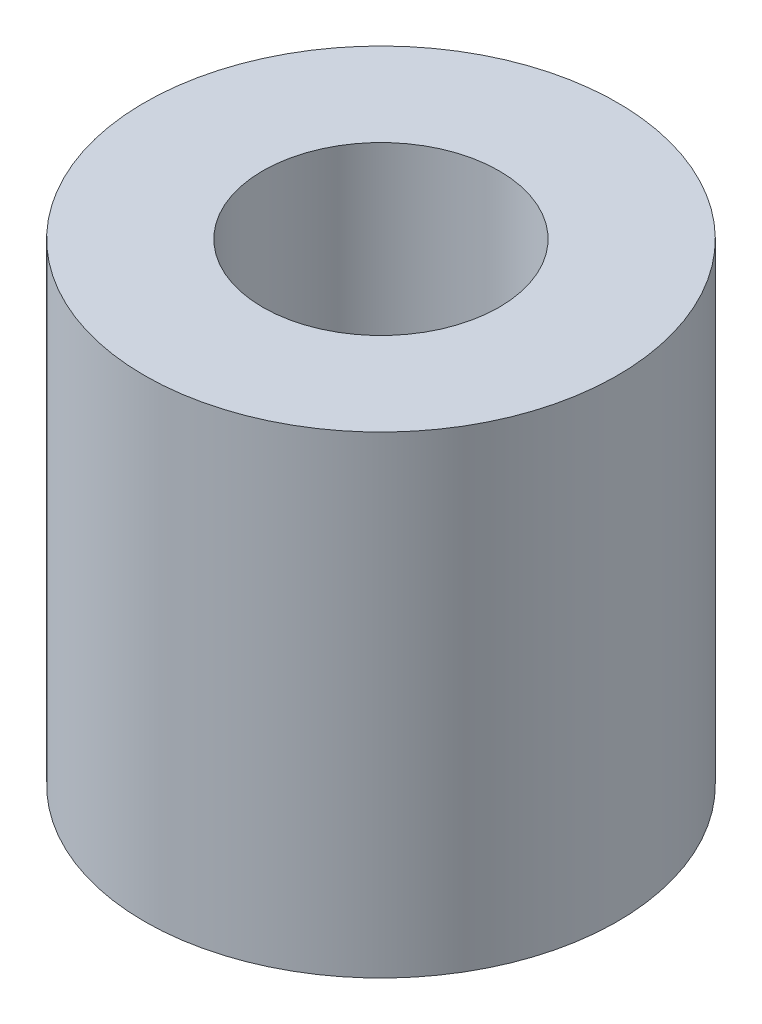
ISO-10303-21;
HEADER;
FILE_DESCRIPTION(('STEP AP214'),'2;1');
FILE_NAME('part.step','',(''),(''),'','','');
FILE_SCHEMA(('AUTOMOTIVE_DESIGN { 1 0 10303 214 1 1 1 1 }'));
ENDSEC;
DATA;
#1=APPLICATION_CONTEXT('core data for automotive mechanical design processes');
#2=APPLICATION_PROTOCOL_DEFINITION('international standard','automotive_design',2000,#1);
#3=PRODUCT_CONTEXT('',#1,'mechanical');
#4=PRODUCT('Part','Part','',(#3));
#5=PRODUCT_RELATED_PRODUCT_CATEGORY('part','',(#4));
#6=PRODUCT_DEFINITION_FORMATION('','',#4);
#7=PRODUCT_DEFINITION_CONTEXT('part definition',#1,'design');
#8=PRODUCT_DEFINITION('design','',#6,#7);
#9=PRODUCT_DEFINITION_SHAPE('','',#8);
#10=(LENGTH_UNIT() NAMED_UNIT(*) SI_UNIT(.MILLI.,.METRE.));
#11=(NAMED_UNIT(*) PLANE_ANGLE_UNIT() SI_UNIT($,.RADIAN.));
#12=(NAMED_UNIT(*) SI_UNIT($,.STERADIAN.) SOLID_ANGLE_UNIT());
#13=UNCERTAINTY_MEASURE_WITH_UNIT(LENGTH_MEASURE(1.E-05),#10,'distance_accuracy_value','');
#14=(GEOMETRIC_REPRESENTATION_CONTEXT(3) GLOBAL_UNCERTAINTY_ASSIGNED_CONTEXT((#13)) GLOBAL_UNIT_ASSIGNED_CONTEXT((#10,
#11,#12)) REPRESENTATION_CONTEXT('',''));
#15=CARTESIAN_POINT('',(0.,0.,0.));
#16=DIRECTION('',(0.,0.,1.));
#17=DIRECTION('',(1.,0.,0.));
#18=AXIS2_PLACEMENT_3D('',#15,#16,#17);
#19=CARTESIAN_POINT('',(0.,12.7,0.));
#20=DIRECTION('',(0.,1.,0.));
#21=DIRECTION('',(0.,0.,1.));
#22=AXIS2_PLACEMENT_3D('',#19,#20,#21);
#23=PLANE('',#22);
#24=CARTESIAN_POINT('',(0.,12.7,0.));
#25=DIRECTION('',(0.,1.,0.));
#26=DIRECTION('',(0.,0.,1.));
#27=AXIS2_PLACEMENT_3D('',#24,#25,#26);
#28=CIRCLE('',#27,6.35);
#29=CARTESIAN_POINT('',(0.,12.7,6.35));
#30=VERTEX_POINT('',#29);
#31=EDGE_CURVE('E10',#30,#30,#28,.T.);
#32=ORIENTED_EDGE('',*,*,#31,.T.);
#33=EDGE_LOOP('',(#32));
#34=FACE_BOUND('',#33,.T.);
#35=CARTESIAN_POINT('',(0.,12.7,0.));
#36=DIRECTION('',(0.,1.,0.));
#37=DIRECTION('',(0.,0.,1.));
#38=AXIS2_PLACEMENT_3D('',#35,#36,#37);
#39=CIRCLE('',#38,3.175);
#40=CARTESIAN_POINT('',(0.,12.7,3.175));
#41=VERTEX_POINT('',#40);
#42=EDGE_CURVE('E42',#41,#41,#39,.T.);
#43=ORIENTED_EDGE('',*,*,#42,.F.);
#44=EDGE_LOOP('',(#43));
#45=FACE_BOUND('',#44,.T.);
#46=ADVANCED_FACE('F31',(#34,#45),#23,.T.);
#47=CARTESIAN_POINT('',(0.,0.,0.));
#48=DIRECTION('',(0.,1.,0.));
#49=DIRECTION('',(0.,0.,1.));
#50=AXIS2_PLACEMENT_3D('',#47,#48,#49);
#51=PLANE('',#50);
#52=CARTESIAN_POINT('',(0.,0.,0.));
#53=DIRECTION('',(0.,1.,0.));
#54=DIRECTION('',(0.,0.,1.));
#55=AXIS2_PLACEMENT_3D('',#52,#53,#54);
#56=CIRCLE('',#55,6.35);
#57=CARTESIAN_POINT('',(0.,0.,6.35));
#58=VERTEX_POINT('',#57);
#59=EDGE_CURVE('E35',#58,#58,#56,.T.);
#60=ORIENTED_EDGE('',*,*,#59,.F.);
#61=EDGE_LOOP('',(#60));
#62=FACE_BOUND('',#61,.T.);
#63=CARTESIAN_POINT('',(0.,0.,0.));
#64=DIRECTION('',(0.,1.,0.));
#65=DIRECTION('',(0.,0.,1.));
#66=AXIS2_PLACEMENT_3D('',#63,#64,#65);
#67=CIRCLE('',#66,3.175);
#68=CARTESIAN_POINT('',(0.,0.,3.175));
#69=VERTEX_POINT('',#68);
#70=EDGE_CURVE('E44',#69,#69,#67,.T.);
#71=ORIENTED_EDGE('',*,*,#70,.T.);
#72=EDGE_LOOP('',(#71));
#73=FACE_BOUND('',#72,.T.);
#74=ADVANCED_FACE('F54',(#62,#73),#51,.F.);
#75=CARTESIAN_POINT('',(0.,12.7,0.));
#76=DIRECTION('',(0.,-1.,0.));
#77=DIRECTION('',(0.,0.,-1.));
#78=AXIS2_PLACEMENT_3D('',#75,#76,#77);
#79=CYLINDRICAL_SURFACE('',#78,6.35);
#80=ORIENTED_EDGE('',*,*,#31,.F.);
#81=EDGE_LOOP('',(#80));
#82=FACE_BOUND('',#81,.T.);
#83=ORIENTED_EDGE('',*,*,#59,.T.);
#84=EDGE_LOOP('',(#83));
#85=FACE_BOUND('',#84,.T.);
#86=ADVANCED_FACE('F33',(#82,#85),#79,.T.);
#87=CARTESIAN_POINT('',(0.,12.7,0.));
#88=DIRECTION('',(0.,-1.,0.));
#89=DIRECTION('',(0.,0.,-1.));
#90=AXIS2_PLACEMENT_3D('',#87,#88,#89);
#91=CYLINDRICAL_SURFACE('',#90,3.175);
#92=ORIENTED_EDGE('',*,*,#42,.T.);
#93=EDGE_LOOP('',(#92));
#94=FACE_BOUND('',#93,.T.);
#95=ORIENTED_EDGE('',*,*,#70,.F.);
#96=EDGE_LOOP('',(#95));
#97=FACE_BOUND('',#96,.T.);
#98=ADVANCED_FACE('F50',(#94,#97),#91,.F.);
#99=CLOSED_SHELL('',(#46,#74,#86,#98));
#100=MANIFOLD_SOLID_BREP('B2',#99);
#101=ADVANCED_BREP_SHAPE_REPRESENTATION('',(#18,#100),#14);
#102=SHAPE_DEFINITION_REPRESENTATION(#9,#101);
ENDSEC;
END-ISO-10303-21;
